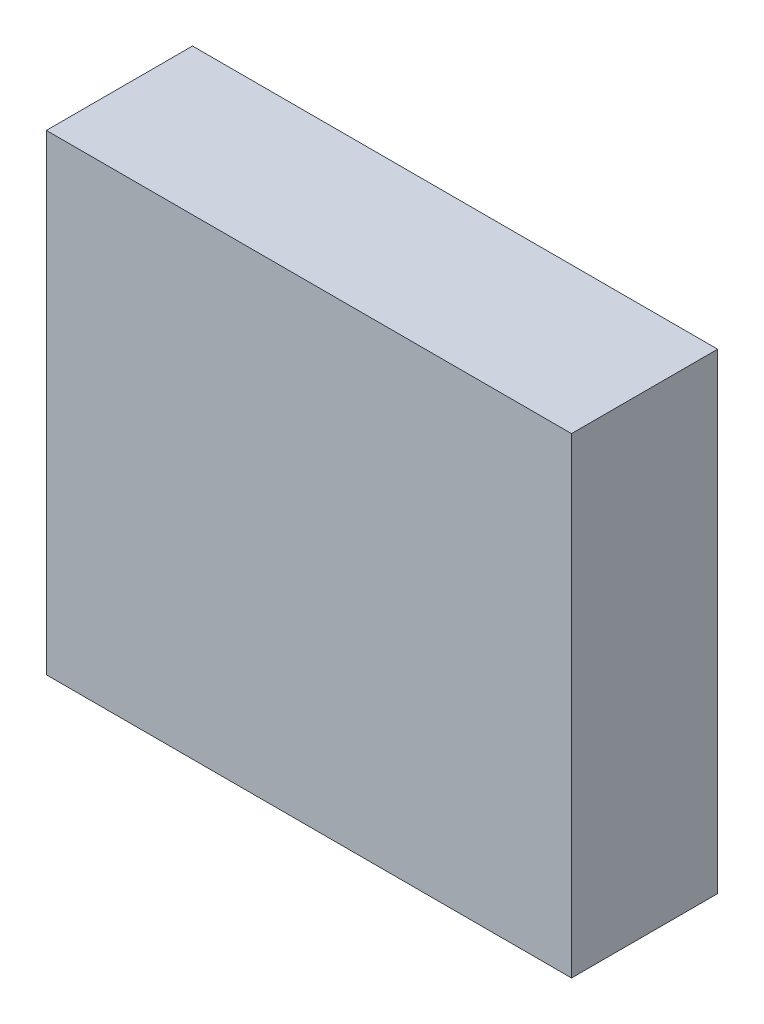
ISO-10303-21;
HEADER;
FILE_DESCRIPTION(('STEP AP214'),'2;1');
FILE_NAME('part.step','',(''),(''),'','','');
FILE_SCHEMA(('AUTOMOTIVE_DESIGN { 1 0 10303 214 1 1 1 1 }'));
ENDSEC;
DATA;
#1=APPLICATION_CONTEXT('core data for automotive mechanical design processes');
#2=APPLICATION_PROTOCOL_DEFINITION('international standard','automotive_design',2000,#1);
#3=PRODUCT_CONTEXT('',#1,'mechanical');
#4=PRODUCT('Part','Part','',(#3));
#5=PRODUCT_RELATED_PRODUCT_CATEGORY('part','',(#4));
#6=PRODUCT_DEFINITION_FORMATION('','',#4);
#7=PRODUCT_DEFINITION_CONTEXT('part definition',#1,'design');
#8=PRODUCT_DEFINITION('design','',#6,#7);
#9=PRODUCT_DEFINITION_SHAPE('','',#8);
#10=(LENGTH_UNIT() NAMED_UNIT(*) SI_UNIT(.MILLI.,.METRE.));
#11=(NAMED_UNIT(*) PLANE_ANGLE_UNIT() SI_UNIT($,.RADIAN.));
#12=(NAMED_UNIT(*) SI_UNIT($,.STERADIAN.) SOLID_ANGLE_UNIT());
#13=UNCERTAINTY_MEASURE_WITH_UNIT(LENGTH_MEASURE(1.E-05),#10,'distance_accuracy_value','');
#14=(GEOMETRIC_REPRESENTATION_CONTEXT(3) GLOBAL_UNCERTAINTY_ASSIGNED_CONTEXT((#13)) GLOBAL_UNIT_ASSIGNED_CONTEXT((#10,
#11,#12)) REPRESENTATION_CONTEXT('',''));
#15=CARTESIAN_POINT('',(0.,0.,0.));
#16=DIRECTION('',(0.,0.,1.));
#17=DIRECTION('',(1.,0.,0.));
#18=AXIS2_PLACEMENT_3D('',#15,#16,#17);
#19=CARTESIAN_POINT('',(0.,290.068,0.));
#20=DIRECTION('',(1.,0.,0.));
#21=DIRECTION('',(0.,0.,-1.));
#22=AXIS2_PLACEMENT_3D('',#19,#20,#21);
#23=PLANE('',#22);
#24=DIRECTION('',(0.,0.,1.));
#25=VECTOR('',#24,1.);
#26=CARTESIAN_POINT('',(0.,0.,0.));
#27=LINE('',#26,#25);
#28=CARTESIAN_POINT('',(0.,0.,-89.916));
#29=VERTEX_POINT('',#28);
#30=CARTESIAN_POINT('',(0.,0.,0.));
#31=VERTEX_POINT('',#30);
#32=EDGE_CURVE('E166',#29,#31,#27,.T.);
#33=ORIENTED_EDGE('',*,*,#32,.T.);
#34=DIRECTION('',(0.,-1.,0.));
#35=VECTOR('',#34,1.);
#36=CARTESIAN_POINT('',(0.,290.068,0.));
#37=LINE('',#36,#35);
#38=CARTESIAN_POINT('',(0.,290.068,0.));
#39=VERTEX_POINT('',#38);
#40=EDGE_CURVE('E11',#39,#31,#37,.T.);
#41=ORIENTED_EDGE('',*,*,#40,.F.);
#42=DIRECTION('',(0.,0.,1.));
#43=VECTOR('',#42,1.);
#44=CARTESIAN_POINT('',(0.,290.068,0.));
#45=LINE('',#44,#43);
#46=CARTESIAN_POINT('',(0.,290.068,-89.916));
#47=VERTEX_POINT('',#46);
#48=EDGE_CURVE('E172',#47,#39,#45,.T.);
#49=ORIENTED_EDGE('',*,*,#48,.F.);
#50=DIRECTION('',(0.,-1.,0.));
#51=VECTOR('',#50,1.);
#52=CARTESIAN_POINT('',(0.,290.068,-89.916));
#53=LINE('',#52,#51);
#54=EDGE_CURVE('E182',#47,#29,#53,.T.);
#55=ORIENTED_EDGE('',*,*,#54,.T.);
#56=EDGE_LOOP('',(#33,#41,#49,#55));
#57=FACE_BOUND('',#56,.T.);
#58=ADVANCED_FACE('F45',(#57),#23,.F.);
#59=CARTESIAN_POINT('',(0.,290.068,0.));
#60=DIRECTION('',(0.,0.,-1.));
#61=DIRECTION('',(-1.,0.,0.));
#62=AXIS2_PLACEMENT_3D('',#59,#60,#61);
#63=PLANE('',#62);
#64=DIRECTION('',(1.,0.,0.));
#65=VECTOR('',#64,1.);
#66=CARTESIAN_POINT('',(0.,0.,0.));
#67=LINE('',#66,#65);
#68=CARTESIAN_POINT('',(323.088,0.,0.));
#69=VERTEX_POINT('',#68);
#70=EDGE_CURVE('E186',#31,#69,#67,.T.);
#71=ORIENTED_EDGE('',*,*,#70,.T.);
#72=DIRECTION('',(0.,-1.,0.));
#73=VECTOR('',#72,1.);
#74=CARTESIAN_POINT('',(323.088,290.068,0.));
#75=LINE('',#74,#73);
#76=CARTESIAN_POINT('',(323.088,290.068,0.));
#77=VERTEX_POINT('',#76);
#78=EDGE_CURVE('E53',#77,#69,#75,.T.);
#79=ORIENTED_EDGE('',*,*,#78,.F.);
#80=DIRECTION('',(1.,0.,0.));
#81=VECTOR('',#80,1.);
#82=CARTESIAN_POINT('',(0.,290.068,0.));
#83=LINE('',#82,#81);
#84=EDGE_CURVE('E97',#39,#77,#83,.T.);
#85=ORIENTED_EDGE('',*,*,#84,.F.);
#86=ORIENTED_EDGE('',*,*,#40,.T.);
#87=EDGE_LOOP('',(#71,#79,#85,#86));
#88=FACE_BOUND('',#87,.T.);
#89=ADVANCED_FACE('F218',(#88),#63,.F.);
#90=CARTESIAN_POINT('',(323.088,290.068,0.));
#91=DIRECTION('',(-1.,0.,0.));
#92=DIRECTION('',(0.,0.,1.));
#93=AXIS2_PLACEMENT_3D('',#90,#91,#92);
#94=PLANE('',#93);
#95=DIRECTION('',(0.,0.,-1.));
#96=VECTOR('',#95,1.);
#97=CARTESIAN_POINT('',(323.088,0.,0.));
#98=LINE('',#97,#96);
#99=CARTESIAN_POINT('',(323.088,0.,-89.916));
#100=VERTEX_POINT('',#99);
#101=EDGE_CURVE('E189',#69,#100,#98,.T.);
#102=ORIENTED_EDGE('',*,*,#101,.T.);
#103=DIRECTION('',(0.,-1.,0.));
#104=VECTOR('',#103,1.);
#105=CARTESIAN_POINT('',(323.088,290.068,-89.916));
#106=LINE('',#105,#104);
#107=CARTESIAN_POINT('',(323.088,290.068,-89.916));
#108=VERTEX_POINT('',#107);
#109=EDGE_CURVE('E196',#108,#100,#106,.T.);
#110=ORIENTED_EDGE('',*,*,#109,.F.);
#111=DIRECTION('',(0.,0.,-1.));
#112=VECTOR('',#111,1.);
#113=CARTESIAN_POINT('',(323.088,290.068,0.));
#114=LINE('',#113,#112);
#115=EDGE_CURVE('E177',#77,#108,#114,.T.);
#116=ORIENTED_EDGE('',*,*,#115,.F.);
#117=ORIENTED_EDGE('',*,*,#78,.T.);
#118=EDGE_LOOP('',(#102,#110,#116,#117));
#119=FACE_BOUND('',#118,.T.);
#120=ADVANCED_FACE('F203',(#119),#94,.F.);
#121=CARTESIAN_POINT('',(0.,290.068,-89.916));
#122=DIRECTION('',(0.,0.,1.));
#123=DIRECTION('',(1.,0.,0.));
#124=AXIS2_PLACEMENT_3D('',#121,#122,#123);
#125=PLANE('',#124);
#126=DIRECTION('',(-1.,0.,0.));
#127=VECTOR('',#126,1.);
#128=CARTESIAN_POINT('',(0.,0.,-89.916));
#129=LINE('',#128,#127);
#130=EDGE_CURVE('E90',#100,#29,#129,.T.);
#131=ORIENTED_EDGE('',*,*,#130,.T.);
#132=ORIENTED_EDGE('',*,*,#54,.F.);
#133=DIRECTION('',(-1.,0.,0.));
#134=VECTOR('',#133,1.);
#135=CARTESIAN_POINT('',(0.,290.068,-89.916));
#136=LINE('',#135,#134);
#137=EDGE_CURVE('E69',#108,#47,#136,.T.);
#138=ORIENTED_EDGE('',*,*,#137,.F.);
#139=ORIENTED_EDGE('',*,*,#109,.T.);
#140=EDGE_LOOP('',(#131,#132,#138,#139));
#141=FACE_BOUND('',#140,.T.);
#142=ADVANCED_FACE('F209',(#141),#125,.F.);
#143=CARTESIAN_POINT('',(0.,290.068,0.));
#144=DIRECTION('',(0.,-1.,0.));
#145=DIRECTION('',(0.,0.,-1.));
#146=AXIS2_PLACEMENT_3D('',#143,#144,#145);
#147=PLANE('',#146);
#148=ORIENTED_EDGE('',*,*,#48,.T.);
#149=ORIENTED_EDGE('',*,*,#84,.T.);
#150=ORIENTED_EDGE('',*,*,#115,.T.);
#151=ORIENTED_EDGE('',*,*,#137,.T.);
#152=EDGE_LOOP('',(#148,#149,#150,#151));
#153=FACE_BOUND('',#152,.T.);
#154=ADVANCED_FACE('F211',(#153),#147,.F.);
#155=CARTESIAN_POINT('',(0.,0.,0.));
#156=DIRECTION('',(0.,-1.,0.));
#157=DIRECTION('',(0.,0.,-1.));
#158=AXIS2_PLACEMENT_3D('',#155,#156,#157);
#159=PLANE('',#158);
#160=DIRECTION('',(0.,0.,-1.));
#161=VECTOR('',#160,1.);
#162=CARTESIAN_POINT('',(318.008,0.,-84.836));
#163=LINE('',#162,#161);
#164=CARTESIAN_POINT('',(318.008,0.,-5.08));
#165=VERTEX_POINT('',#164);
#166=CARTESIAN_POINT('',(318.008,0.,-84.836));
#167=VERTEX_POINT('',#166);
#168=EDGE_CURVE('E123',#165,#167,#163,.T.);
#169=ORIENTED_EDGE('',*,*,#168,.T.);
#170=DIRECTION('',(-1.,0.,0.));
#171=VECTOR('',#170,1.);
#172=CARTESIAN_POINT('',(5.08000000000003,0.,-84.836));
#173=LINE('',#172,#171);
#174=CARTESIAN_POINT('',(5.08000000000003,0.,-84.836));
#175=VERTEX_POINT('',#174);
#176=EDGE_CURVE('E135',#167,#175,#173,.T.);
#177=ORIENTED_EDGE('',*,*,#176,.T.);
#178=DIRECTION('',(0.,0.,1.));
#179=VECTOR('',#178,1.);
#180=CARTESIAN_POINT('',(5.08000000000003,0.,-84.836));
#181=LINE('',#180,#179);
#182=CARTESIAN_POINT('',(5.08000000000002,0.,-5.08));
#183=VERTEX_POINT('',#182);
#184=EDGE_CURVE('E60',#175,#183,#181,.T.);
#185=ORIENTED_EDGE('',*,*,#184,.T.);
#186=DIRECTION('',(1.,0.,0.));
#187=VECTOR('',#186,1.);
#188=CARTESIAN_POINT('',(5.08000000000002,0.,-5.08));
#189=LINE('',#188,#187);
#190=EDGE_CURVE('E132',#183,#165,#189,.T.);
#191=ORIENTED_EDGE('',*,*,#190,.T.);
#192=EDGE_LOOP('',(#169,#177,#185,#191));
#193=FACE_BOUND('',#192,.T.);
#194=ORIENTED_EDGE('',*,*,#32,.F.);
#195=ORIENTED_EDGE('',*,*,#130,.F.);
#196=ORIENTED_EDGE('',*,*,#101,.F.);
#197=ORIENTED_EDGE('',*,*,#70,.F.);
#198=EDGE_LOOP('',(#194,#195,#196,#197));
#199=FACE_BOUND('',#198,.T.);
#200=ADVANCED_FACE('F140',(#193,#199),#159,.T.);
#201=CARTESIAN_POINT('',(318.008,0.,-84.836));
#202=DIRECTION('',(1.,0.,0.));
#203=DIRECTION('',(0.,0.,-1.));
#204=AXIS2_PLACEMENT_3D('',#201,#202,#203);
#205=PLANE('',#204);
#206=DIRECTION('',(0.,0.,-1.));
#207=VECTOR('',#206,1.);
#208=CARTESIAN_POINT('',(318.008,284.988,-84.836));
#209=LINE('',#208,#207);
#210=CARTESIAN_POINT('',(318.008,284.988,-5.08));
#211=VERTEX_POINT('',#210);
#212=CARTESIAN_POINT('',(318.008,284.988,-84.836));
#213=VERTEX_POINT('',#212);
#214=EDGE_CURVE('E126',#211,#213,#209,.T.);
#215=ORIENTED_EDGE('',*,*,#214,.T.);
#216=DIRECTION('',(0.,1.,0.));
#217=VECTOR('',#216,1.);
#218=CARTESIAN_POINT('',(318.008,0.,-84.836));
#219=LINE('',#218,#217);
#220=EDGE_CURVE('E119',#167,#213,#219,.T.);
#221=ORIENTED_EDGE('',*,*,#220,.F.);
#222=ORIENTED_EDGE('',*,*,#168,.F.);
#223=DIRECTION('',(0.,1.,0.));
#224=VECTOR('',#223,1.);
#225=CARTESIAN_POINT('',(318.008,0.,-5.08));
#226=LINE('',#225,#224);
#227=EDGE_CURVE('E163',#165,#211,#226,.T.);
#228=ORIENTED_EDGE('',*,*,#227,.T.);
#229=EDGE_LOOP('',(#215,#221,#222,#228));
#230=FACE_BOUND('',#229,.T.);
#231=ADVANCED_FACE('F121',(#230),#205,.F.);
#232=CARTESIAN_POINT('',(5.08000000000002,0.,-5.08));
#233=DIRECTION('',(0.,0.,1.));
#234=DIRECTION('',(1.,0.,0.));
#235=AXIS2_PLACEMENT_3D('',#232,#233,#234);
#236=PLANE('',#235);
#237=DIRECTION('',(1.,0.,0.));
#238=VECTOR('',#237,1.);
#239=CARTESIAN_POINT('',(5.08000000000002,284.988,-5.08));
#240=LINE('',#239,#238);
#241=CARTESIAN_POINT('',(5.08000000000002,284.988,-5.08));
#242=VERTEX_POINT('',#241);
#243=EDGE_CURVE('E144',#242,#211,#240,.T.);
#244=ORIENTED_EDGE('',*,*,#243,.T.);
#245=ORIENTED_EDGE('',*,*,#227,.F.);
#246=ORIENTED_EDGE('',*,*,#190,.F.);
#247=DIRECTION('',(0.,1.,0.));
#248=VECTOR('',#247,1.);
#249=CARTESIAN_POINT('',(5.08000000000002,0.,-5.08));
#250=LINE('',#249,#248);
#251=EDGE_CURVE('E167',#183,#242,#250,.T.);
#252=ORIENTED_EDGE('',*,*,#251,.T.);
#253=EDGE_LOOP('',(#244,#245,#246,#252));
#254=FACE_BOUND('',#253,.T.);
#255=ADVANCED_FACE('F259',(#254),#236,.F.);
#256=CARTESIAN_POINT('',(5.08000000000003,0.,-84.836));
#257=DIRECTION('',(-1.,0.,0.));
#258=DIRECTION('',(0.,0.,1.));
#259=AXIS2_PLACEMENT_3D('',#256,#257,#258);
#260=PLANE('',#259);
#261=DIRECTION('',(0.,0.,1.));
#262=VECTOR('',#261,1.);
#263=CARTESIAN_POINT('',(5.08000000000003,284.988,-84.836));
#264=LINE('',#263,#262);
#265=CARTESIAN_POINT('',(5.08000000000003,284.988,-84.836));
#266=VERTEX_POINT('',#265);
#267=EDGE_CURVE('E148',#266,#242,#264,.T.);
#268=ORIENTED_EDGE('',*,*,#267,.T.);
#269=ORIENTED_EDGE('',*,*,#251,.F.);
#270=ORIENTED_EDGE('',*,*,#184,.F.);
#271=DIRECTION('',(0.,1.,0.));
#272=VECTOR('',#271,1.);
#273=CARTESIAN_POINT('',(5.08000000000003,0.,-84.836));
#274=LINE('',#273,#272);
#275=EDGE_CURVE('E131',#175,#266,#274,.T.);
#276=ORIENTED_EDGE('',*,*,#275,.T.);
#277=EDGE_LOOP('',(#268,#269,#270,#276));
#278=FACE_BOUND('',#277,.T.);
#279=ADVANCED_FACE('F268',(#278),#260,.F.);
#280=CARTESIAN_POINT('',(5.08000000000003,0.,-84.836));
#281=DIRECTION('',(0.,0.,-1.));
#282=DIRECTION('',(-1.,0.,0.));
#283=AXIS2_PLACEMENT_3D('',#280,#281,#282);
#284=PLANE('',#283);
#285=DIRECTION('',(-1.,0.,0.));
#286=VECTOR('',#285,1.);
#287=CARTESIAN_POINT('',(5.08000000000003,284.988,-84.836));
#288=LINE('',#287,#286);
#289=EDGE_CURVE('E157',#213,#266,#288,.T.);
#290=ORIENTED_EDGE('',*,*,#289,.T.);
#291=ORIENTED_EDGE('',*,*,#275,.F.);
#292=ORIENTED_EDGE('',*,*,#176,.F.);
#293=ORIENTED_EDGE('',*,*,#220,.T.);
#294=EDGE_LOOP('',(#290,#291,#292,#293));
#295=FACE_BOUND('',#294,.T.);
#296=ADVANCED_FACE('F136',(#295),#284,.F.);
#297=CARTESIAN_POINT('',(0.,284.988,0.));
#298=DIRECTION('',(0.,1.,0.));
#299=DIRECTION('',(0.,0.,1.));
#300=AXIS2_PLACEMENT_3D('',#297,#298,#299);
#301=PLANE('',#300);
#302=ORIENTED_EDGE('',*,*,#214,.F.);
#303=ORIENTED_EDGE('',*,*,#243,.F.);
#304=ORIENTED_EDGE('',*,*,#267,.F.);
#305=ORIENTED_EDGE('',*,*,#289,.F.);
#306=EDGE_LOOP('',(#302,#303,#304,#305));
#307=FACE_BOUND('',#306,.T.);
#308=ADVANCED_FACE('F286',(#307),#301,.F.);
#309=CLOSED_SHELL('',(#58,#89,#120,#142,#154,#200,#231,#255,#279,#296,#308));
#310=MANIFOLD_SOLID_BREP('B2',#309);
#311=ADVANCED_BREP_SHAPE_REPRESENTATION('',(#18,#310),#14);
#312=SHAPE_DEFINITION_REPRESENTATION(#9,#311);
ENDSEC;
END-ISO-10303-21;
